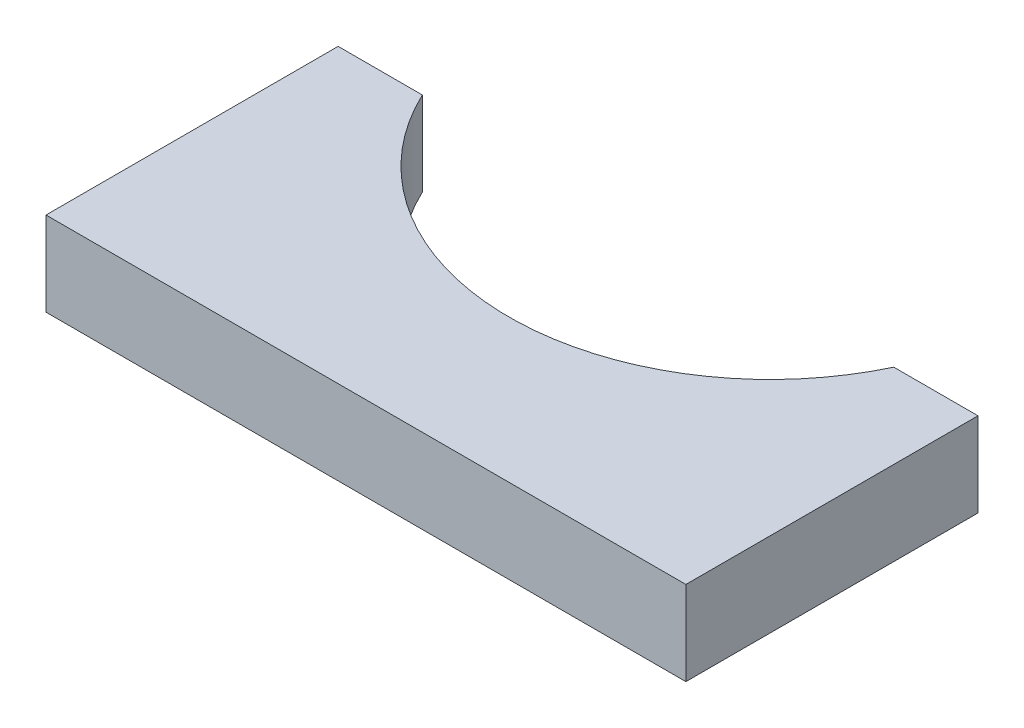
ISO-10303-21;
HEADER;
FILE_DESCRIPTION(('STEP AP214'),'2;1');
FILE_NAME('part.step','',(''),(''),'','','');
FILE_SCHEMA(('AUTOMOTIVE_DESIGN { 1 0 10303 214 1 1 1 1 }'));
ENDSEC;
DATA;
#1=APPLICATION_CONTEXT('core data for automotive mechanical design processes');
#2=APPLICATION_PROTOCOL_DEFINITION('international standard','automotive_design',2000,#1);
#3=PRODUCT_CONTEXT('',#1,'mechanical');
#4=PRODUCT('Part','Part','',(#3));
#5=PRODUCT_RELATED_PRODUCT_CATEGORY('part','',(#4));
#6=PRODUCT_DEFINITION_FORMATION('','',#4);
#7=PRODUCT_DEFINITION_CONTEXT('part definition',#1,'design');
#8=PRODUCT_DEFINITION('design','',#6,#7);
#9=PRODUCT_DEFINITION_SHAPE('','',#8);
#10=(LENGTH_UNIT() NAMED_UNIT(*) SI_UNIT(.MILLI.,.METRE.));
#11=(NAMED_UNIT(*) PLANE_ANGLE_UNIT() SI_UNIT($,.RADIAN.));
#12=(NAMED_UNIT(*) SI_UNIT($,.STERADIAN.) SOLID_ANGLE_UNIT());
#13=UNCERTAINTY_MEASURE_WITH_UNIT(LENGTH_MEASURE(1.E-05),#10,'distance_accuracy_value','');
#14=(GEOMETRIC_REPRESENTATION_CONTEXT(3) GLOBAL_UNCERTAINTY_ASSIGNED_CONTEXT((#13)) GLOBAL_UNIT_ASSIGNED_CONTEXT((#10,
#11,#12)) REPRESENTATION_CONTEXT('',''));
#15=CARTESIAN_POINT('',(0.,0.,0.));
#16=DIRECTION('',(0.,0.,1.));
#17=DIRECTION('',(1.,0.,0.));
#18=AXIS2_PLACEMENT_3D('',#15,#16,#17);
#19=CARTESIAN_POINT('',(38.,127.5,0.));
#20=DIRECTION('',(1.,0.,0.));
#21=DIRECTION('',(0.,0.,-1.));
#22=AXIS2_PLACEMENT_3D('',#19,#20,#21);
#23=PLANE('',#22);
#24=DIRECTION('',(0.,1.,0.));
#25=VECTOR('',#24,1.);
#26=CARTESIAN_POINT('',(38.,127.5,48.));
#27=LINE('',#26,#25);
#28=CARTESIAN_POINT('',(38.,117.5,48.));
#29=VERTEX_POINT('',#28);
#30=CARTESIAN_POINT('',(38.,127.5,48.));
#31=VERTEX_POINT('',#30);
#32=EDGE_CURVE('E11',#29,#31,#27,.T.);
#33=ORIENTED_EDGE('',*,*,#32,.F.);
#34=DIRECTION('',(0.,0.,1.));
#35=VECTOR('',#34,1.);
#36=CARTESIAN_POINT('',(38.,117.5,0.));
#37=LINE('',#36,#35);
#38=CARTESIAN_POINT('',(38.,117.5,13.3041346956501));
#39=VERTEX_POINT('',#38);
#40=EDGE_CURVE('E97',#29,#39,#37,.F.);
#41=ORIENTED_EDGE('',*,*,#40,.T.);
#42=DIRECTION('',(0.,1.,0.));
#43=VECTOR('',#42,1.);
#44=CARTESIAN_POINT('',(38.,127.5,13.3041346956501));
#45=LINE('',#44,#43);
#46=CARTESIAN_POINT('',(38.,127.5,13.3041346956501));
#47=VERTEX_POINT('',#46);
#48=EDGE_CURVE('E46',#39,#47,#45,.T.);
#49=ORIENTED_EDGE('',*,*,#48,.T.);
#50=DIRECTION('',(0.,0.,-1.));
#51=VECTOR('',#50,1.);
#52=CARTESIAN_POINT('',(38.,127.5,0.));
#53=LINE('',#52,#51);
#54=EDGE_CURVE('E124',#31,#47,#53,.T.);
#55=ORIENTED_EDGE('',*,*,#54,.F.);
#56=EDGE_LOOP('',(#33,#41,#49,#55));
#57=FACE_BOUND('',#56,.T.);
#58=ADVANCED_FACE('F36',(#57),#23,.T.);
#59=CARTESIAN_POINT('',(0.,127.5,13.3041346956501));
#60=DIRECTION('',(0.,0.,-1.));
#61=DIRECTION('',(-1.,0.,0.));
#62=AXIS2_PLACEMENT_3D('',#59,#60,#61);
#63=PLANE('',#62);
#64=ORIENTED_EDGE('',*,*,#48,.F.);
#65=DIRECTION('',(1.,0.,0.));
#66=VECTOR('',#65,1.);
#67=CARTESIAN_POINT('',(0.,117.5,13.3041346956501));
#68=LINE('',#67,#66);
#69=CARTESIAN_POINT('',(28.,117.5,13.3041346956501));
#70=VERTEX_POINT('',#69);
#71=EDGE_CURVE('E110',#39,#70,#68,.F.);
#72=ORIENTED_EDGE('',*,*,#71,.T.);
#73=DIRECTION('',(0.,1.,0.));
#74=VECTOR('',#73,1.);
#75=CARTESIAN_POINT('',(28.,127.5,13.3041346956501));
#76=LINE('',#75,#74);
#77=CARTESIAN_POINT('',(28.,127.5,13.3041346956501));
#78=VERTEX_POINT('',#77);
#79=EDGE_CURVE('E117',#70,#78,#76,.T.);
#80=ORIENTED_EDGE('',*,*,#79,.T.);
#81=DIRECTION('',(-1.,0.,0.));
#82=VECTOR('',#81,1.);
#83=CARTESIAN_POINT('',(0.,127.5,13.3041346956501));
#84=LINE('',#83,#82);
#85=EDGE_CURVE('E132',#47,#78,#84,.T.);
#86=ORIENTED_EDGE('',*,*,#85,.F.);
#87=EDGE_LOOP('',(#64,#72,#80,#86));
#88=FACE_BOUND('',#87,.T.);
#89=ADVANCED_FACE('F135',(#88),#63,.T.);
#90=CARTESIAN_POINT('',(0.,127.5,0.));
#91=DIRECTION('',(0.,1.,0.));
#92=DIRECTION('',(0.,0.,1.));
#93=AXIS2_PLACEMENT_3D('',#90,#91,#92);
#94=CYLINDRICAL_SURFACE('',#93,31.);
#95=ORIENTED_EDGE('',*,*,#79,.F.);
#96=CARTESIAN_POINT('',(0.,117.5,0.));
#97=DIRECTION('',(0.,1.,0.));
#98=DIRECTION('',(0.,0.,1.));
#99=AXIS2_PLACEMENT_3D('',#96,#97,#98);
#100=CIRCLE('',#99,31.);
#101=CARTESIAN_POINT('',(-28.,117.5,13.30413469565));
#102=VERTEX_POINT('',#101);
#103=EDGE_CURVE('E107',#102,#70,#100,.T.);
#104=ORIENTED_EDGE('',*,*,#103,.F.);
#105=DIRECTION('',(0.,1.,0.));
#106=VECTOR('',#105,1.);
#107=CARTESIAN_POINT('',(-28.,127.5,13.30413469565));
#108=LINE('',#107,#106);
#109=CARTESIAN_POINT('',(-28.,127.5,13.30413469565));
#110=VERTEX_POINT('',#109);
#111=EDGE_CURVE('E115',#102,#110,#108,.T.);
#112=ORIENTED_EDGE('',*,*,#111,.T.);
#113=CARTESIAN_POINT('',(0.,127.5,0.));
#114=DIRECTION('',(0.,1.,0.));
#115=DIRECTION('',(0.,0.,1.));
#116=AXIS2_PLACEMENT_3D('',#113,#114,#115);
#117=CIRCLE('',#116,31.);
#118=EDGE_CURVE('E136',#110,#78,#117,.T.);
#119=ORIENTED_EDGE('',*,*,#118,.T.);
#120=EDGE_LOOP('',(#95,#104,#112,#119));
#121=FACE_BOUND('',#120,.T.);
#122=ADVANCED_FACE('F144',(#121),#94,.F.);
#123=CARTESIAN_POINT('',(0.,127.5,13.30413469565));
#124=DIRECTION('',(0.,0.,1.));
#125=DIRECTION('',(1.,0.,0.));
#126=AXIS2_PLACEMENT_3D('',#123,#124,#125);
#127=PLANE('',#126);
#128=ORIENTED_EDGE('',*,*,#111,.F.);
#129=DIRECTION('',(1.,0.,0.));
#130=VECTOR('',#129,1.);
#131=CARTESIAN_POINT('',(0.,117.5,13.30413469565));
#132=LINE('',#131,#130);
#133=CARTESIAN_POINT('',(-38.,117.5,13.30413469565));
#134=VERTEX_POINT('',#133);
#135=EDGE_CURVE('E104',#134,#102,#132,.T.);
#136=ORIENTED_EDGE('',*,*,#135,.F.);
#137=DIRECTION('',(0.,1.,0.));
#138=VECTOR('',#137,1.);
#139=CARTESIAN_POINT('',(-38.,127.5,13.30413469565));
#140=LINE('',#139,#138);
#141=CARTESIAN_POINT('',(-38.,127.5,13.30413469565));
#142=VERTEX_POINT('',#141);
#143=EDGE_CURVE('E54',#134,#142,#140,.T.);
#144=ORIENTED_EDGE('',*,*,#143,.T.);
#145=DIRECTION('',(1.,0.,0.));
#146=VECTOR('',#145,1.);
#147=CARTESIAN_POINT('',(0.,127.5,13.30413469565));
#148=LINE('',#147,#146);
#149=EDGE_CURVE('E90',#142,#110,#148,.T.);
#150=ORIENTED_EDGE('',*,*,#149,.T.);
#151=EDGE_LOOP('',(#128,#136,#144,#150));
#152=FACE_BOUND('',#151,.T.);
#153=ADVANCED_FACE('F141',(#152),#127,.F.);
#154=CARTESIAN_POINT('',(-38.,127.5,0.));
#155=DIRECTION('',(1.,0.,0.));
#156=DIRECTION('',(0.,0.,-1.));
#157=AXIS2_PLACEMENT_3D('',#154,#155,#156);
#158=PLANE('',#157);
#159=ORIENTED_EDGE('',*,*,#143,.F.);
#160=DIRECTION('',(0.,0.,1.));
#161=VECTOR('',#160,1.);
#162=CARTESIAN_POINT('',(-38.,117.5,0.));
#163=LINE('',#162,#161);
#164=CARTESIAN_POINT('',(-38.,117.5,48.));
#165=VERTEX_POINT('',#164);
#166=EDGE_CURVE('E95',#165,#134,#163,.F.);
#167=ORIENTED_EDGE('',*,*,#166,.F.);
#168=DIRECTION('',(0.,1.,0.));
#169=VECTOR('',#168,1.);
#170=CARTESIAN_POINT('',(-38.,127.5,48.));
#171=LINE('',#170,#169);
#172=CARTESIAN_POINT('',(-38.,127.5,48.));
#173=VERTEX_POINT('',#172);
#174=EDGE_CURVE('E40',#165,#173,#171,.T.);
#175=ORIENTED_EDGE('',*,*,#174,.T.);
#176=DIRECTION('',(0.,0.,-1.));
#177=VECTOR('',#176,1.);
#178=CARTESIAN_POINT('',(-38.,127.5,0.));
#179=LINE('',#178,#177);
#180=EDGE_CURVE('E106',#173,#142,#179,.T.);
#181=ORIENTED_EDGE('',*,*,#180,.T.);
#182=EDGE_LOOP('',(#159,#167,#175,#181));
#183=FACE_BOUND('',#182,.T.);
#184=ADVANCED_FACE('F99',(#183),#158,.F.);
#185=CARTESIAN_POINT('',(0.,127.5,48.));
#186=DIRECTION('',(0.,0.,1.));
#187=DIRECTION('',(1.,0.,0.));
#188=AXIS2_PLACEMENT_3D('',#185,#186,#187);
#189=PLANE('',#188);
#190=DIRECTION('',(1.,0.,0.));
#191=VECTOR('',#190,1.);
#192=CARTESIAN_POINT('',(0.,117.5,48.));
#193=LINE('',#192,#191);
#194=EDGE_CURVE('E84',#165,#29,#193,.T.);
#195=ORIENTED_EDGE('',*,*,#194,.T.);
#196=ORIENTED_EDGE('',*,*,#32,.T.);
#197=DIRECTION('',(1.,0.,0.));
#198=VECTOR('',#197,1.);
#199=CARTESIAN_POINT('',(0.,127.5,48.));
#200=LINE('',#199,#198);
#201=EDGE_CURVE('E86',#173,#31,#200,.T.);
#202=ORIENTED_EDGE('',*,*,#201,.F.);
#203=ORIENTED_EDGE('',*,*,#174,.F.);
#204=EDGE_LOOP('',(#195,#196,#202,#203));
#205=FACE_BOUND('',#204,.T.);
#206=ADVANCED_FACE('F38',(#205),#189,.T.);
#207=CARTESIAN_POINT('',(0.,127.5,0.));
#208=DIRECTION('',(0.,1.,0.));
#209=DIRECTION('',(0.,0.,1.));
#210=AXIS2_PLACEMENT_3D('',#207,#208,#209);
#211=PLANE('',#210);
#212=ORIENTED_EDGE('',*,*,#180,.F.);
#213=ORIENTED_EDGE('',*,*,#201,.T.);
#214=ORIENTED_EDGE('',*,*,#54,.T.);
#215=ORIENTED_EDGE('',*,*,#85,.T.);
#216=ORIENTED_EDGE('',*,*,#118,.F.);
#217=ORIENTED_EDGE('',*,*,#149,.F.);
#218=EDGE_LOOP('',(#212,#213,#214,#215,#216,#217));
#219=FACE_BOUND('',#218,.T.);
#220=ADVANCED_FACE('F130',(#219),#211,.T.);
#221=CARTESIAN_POINT('',(0.,117.5,0.));
#222=DIRECTION('',(0.,1.,0.));
#223=DIRECTION('',(0.,0.,1.));
#224=AXIS2_PLACEMENT_3D('',#221,#222,#223);
#225=PLANE('',#224);
#226=ORIENTED_EDGE('',*,*,#166,.T.);
#227=ORIENTED_EDGE('',*,*,#135,.T.);
#228=ORIENTED_EDGE('',*,*,#103,.T.);
#229=ORIENTED_EDGE('',*,*,#71,.F.);
#230=ORIENTED_EDGE('',*,*,#40,.F.);
#231=ORIENTED_EDGE('',*,*,#194,.F.);
#232=EDGE_LOOP('',(#226,#227,#228,#229,#230,#231));
#233=FACE_BOUND('',#232,.T.);
#234=ADVANCED_FACE('F93',(#233),#225,.F.);
#235=CLOSED_SHELL('',(#58,#89,#122,#153,#184,#206,#220,#234));
#236=MANIFOLD_SOLID_BREP('B2',#235);
#237=ADVANCED_BREP_SHAPE_REPRESENTATION('',(#18,#236),#14);
#238=SHAPE_DEFINITION_REPRESENTATION(#9,#237);
ENDSEC;
END-ISO-10303-21;
